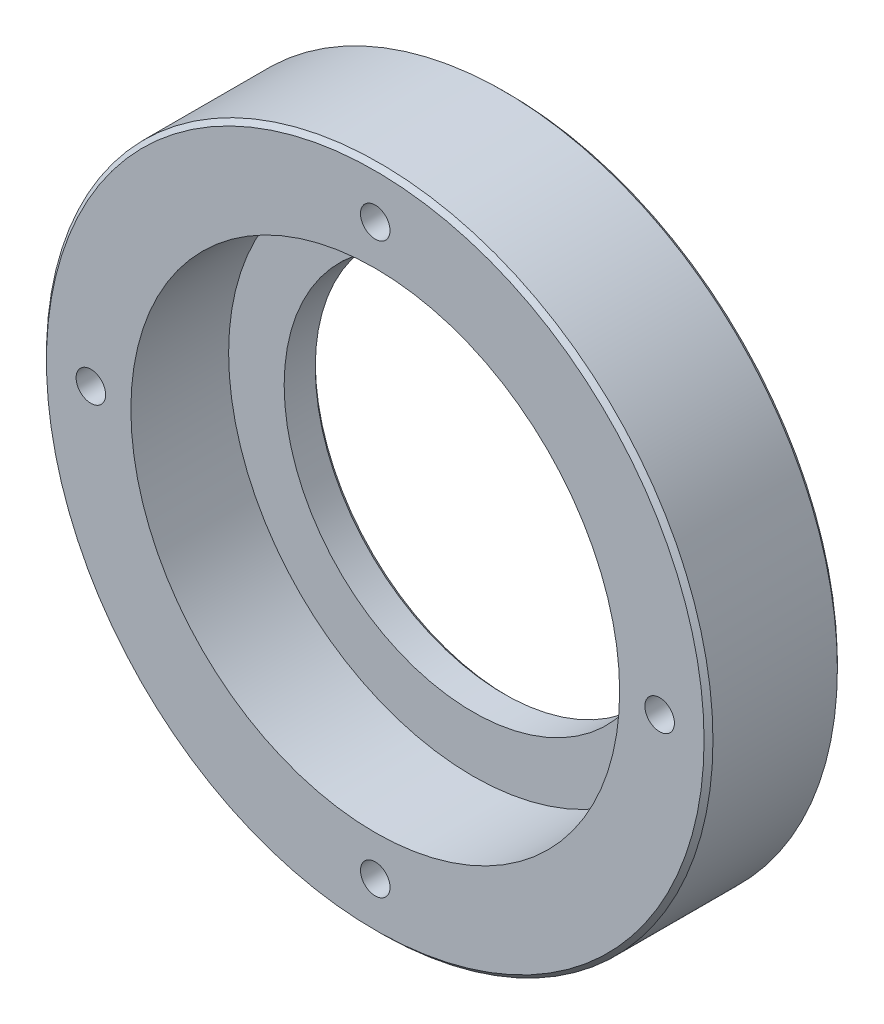
ISO-10303-21;
HEADER;
FILE_DESCRIPTION(('STEP AP214'),'2;1');
FILE_NAME('part.step','',(''),(''),'','','');
FILE_SCHEMA(('AUTOMOTIVE_DESIGN { 1 0 10303 214 1 1 1 1 }'));
ENDSEC;
DATA;
#1=APPLICATION_CONTEXT('core data for automotive mechanical design processes');
#2=APPLICATION_PROTOCOL_DEFINITION('international standard','automotive_design',2000,#1);
#3=PRODUCT_CONTEXT('',#1,'mechanical');
#4=PRODUCT('Part','Part','',(#3));
#5=PRODUCT_RELATED_PRODUCT_CATEGORY('part','',(#4));
#6=PRODUCT_DEFINITION_FORMATION('','',#4);
#7=PRODUCT_DEFINITION_CONTEXT('part definition',#1,'design');
#8=PRODUCT_DEFINITION('design','',#6,#7);
#9=PRODUCT_DEFINITION_SHAPE('','',#8);
#10=(LENGTH_UNIT() NAMED_UNIT(*) SI_UNIT(.MILLI.,.METRE.));
#11=(NAMED_UNIT(*) PLANE_ANGLE_UNIT() SI_UNIT($,.RADIAN.));
#12=(NAMED_UNIT(*) SI_UNIT($,.STERADIAN.) SOLID_ANGLE_UNIT());
#13=UNCERTAINTY_MEASURE_WITH_UNIT(LENGTH_MEASURE(1.E-05),#10,'distance_accuracy_value','');
#14=(GEOMETRIC_REPRESENTATION_CONTEXT(3) GLOBAL_UNCERTAINTY_ASSIGNED_CONTEXT((#13)) GLOBAL_UNIT_ASSIGNED_CONTEXT((#10,
#11,#12)) REPRESENTATION_CONTEXT('',''));
#15=CARTESIAN_POINT('',(0.,0.,0.));
#16=DIRECTION('',(0.,0.,1.));
#17=DIRECTION('',(1.,0.,0.));
#18=AXIS2_PLACEMENT_3D('',#15,#16,#17);
#19=CARTESIAN_POINT('',(0.,0.,0.));
#20=DIRECTION('',(0.,0.,1.));
#21=DIRECTION('',(1.,0.,0.));
#22=AXIS2_PLACEMENT_3D('',#19,#20,#21);
#23=CYLINDRICAL_SURFACE('',#22,75.);
#24=CARTESIAN_POINT('',(0.,0.,0.99999999999778));
#25=DIRECTION('',(0.,0.,-1.));
#26=DIRECTION('',(-1.,0.,0.));
#27=AXIS2_PLACEMENT_3D('',#24,#25,#26);
#28=CIRCLE('',#27,75.);
#29=CARTESIAN_POINT('',(-75.,0.,0.99999999999778));
#30=VERTEX_POINT('',#29);
#31=EDGE_CURVE('E41',#30,#30,#28,.F.);
#32=ORIENTED_EDGE('',*,*,#31,.T.);
#33=EDGE_LOOP('',(#32));
#34=FACE_BOUND('',#33,.T.);
#35=CARTESIAN_POINT('',(0.,0.,28.999999999997));
#36=DIRECTION('',(0.,0.,1.));
#37=DIRECTION('',(1.,0.,0.));
#38=AXIS2_PLACEMENT_3D('',#35,#36,#37);
#39=CIRCLE('',#38,75.);
#40=CARTESIAN_POINT('',(75.,0.,28.999999999997));
#41=VERTEX_POINT('',#40);
#42=EDGE_CURVE('E141',#41,#41,#39,.F.);
#43=ORIENTED_EDGE('',*,*,#42,.T.);
#44=EDGE_LOOP('',(#43));
#45=FACE_BOUND('',#44,.T.);
#46=ADVANCED_FACE('F33',(#34,#45),#23,.T.);
#47=CARTESIAN_POINT('',(75.,0.,0.));
#48=DIRECTION('',(0.,0.,-1.));
#49=DIRECTION('',(-1.,0.,0.));
#50=AXIS2_PLACEMENT_3D('',#47,#48,#49);
#51=PLANE('',#50);
#52=CARTESIAN_POINT('',(0.,0.,0.));
#53=DIRECTION('',(0.,0.,-1.));
#54=DIRECTION('',(-1.,0.,0.));
#55=AXIS2_PLACEMENT_3D('',#52,#53,#54);
#56=CIRCLE('',#55,43.4999999999978);
#57=CARTESIAN_POINT('',(-43.4999999999978,0.,0.));
#58=VERTEX_POINT('',#57);
#59=EDGE_CURVE('E135',#58,#58,#56,.F.);
#60=ORIENTED_EDGE('',*,*,#59,.T.);
#61=EDGE_LOOP('',(#60));
#62=FACE_BOUND('',#61,.T.);
#63=CARTESIAN_POINT('',(0.,0.,0.));
#64=DIRECTION('',(0.,0.,-1.));
#65=DIRECTION('',(-1.,0.,0.));
#66=AXIS2_PLACEMENT_3D('',#63,#64,#65);
#67=CIRCLE('',#66,73.9999999999971);
#68=CARTESIAN_POINT('',(-73.9999999999971,0.,0.));
#69=VERTEX_POINT('',#68);
#70=EDGE_CURVE('E132',#69,#69,#67,.T.);
#71=ORIENTED_EDGE('',*,*,#70,.T.);
#72=EDGE_LOOP('',(#71));
#73=FACE_BOUND('',#72,.T.);
#74=CARTESIAN_POINT('',(-45.254833995939,45.2548339959391,0.));
#75=DIRECTION('',(0.,0.,-1.));
#76=DIRECTION('',(-1.,0.,0.));
#77=AXIS2_PLACEMENT_3D('',#74,#75,#76);
#78=CIRCLE('',#77,4.188);
#79=CARTESIAN_POINT('',(-49.442833995939,45.2548339959391,0.));
#80=VERTEX_POINT('',#79);
#81=EDGE_CURVE('E99',#80,#80,#78,.T.);
#82=ORIENTED_EDGE('',*,*,#81,.F.);
#83=EDGE_LOOP('',(#82));
#84=FACE_BOUND('',#83,.T.);
#85=CARTESIAN_POINT('',(45.2548339959391,45.254833995939,0.));
#86=DIRECTION('',(0.,0.,-1.));
#87=DIRECTION('',(-1.,0.,0.));
#88=AXIS2_PLACEMENT_3D('',#85,#86,#87);
#89=CIRCLE('',#88,4.188);
#90=CARTESIAN_POINT('',(41.0668339959391,45.254833995939,0.));
#91=VERTEX_POINT('',#90);
#92=EDGE_CURVE('E105',#91,#91,#89,.T.);
#93=ORIENTED_EDGE('',*,*,#92,.F.);
#94=EDGE_LOOP('',(#93));
#95=FACE_BOUND('',#94,.T.);
#96=CARTESIAN_POINT('',(45.254833995939,-45.2548339959391,0.));
#97=DIRECTION('',(0.,0.,-1.));
#98=DIRECTION('',(-1.,0.,0.));
#99=AXIS2_PLACEMENT_3D('',#96,#97,#98);
#100=CIRCLE('',#99,4.188);
#101=CARTESIAN_POINT('',(41.066833995939,-45.2548339959391,0.));
#102=VERTEX_POINT('',#101);
#103=EDGE_CURVE('E111',#102,#102,#100,.T.);
#104=ORIENTED_EDGE('',*,*,#103,.F.);
#105=EDGE_LOOP('',(#104));
#106=FACE_BOUND('',#105,.T.);
#107=CARTESIAN_POINT('',(-45.2548339959391,-45.254833995939,0.));
#108=DIRECTION('',(0.,0.,-1.));
#109=DIRECTION('',(-1.,0.,0.));
#110=AXIS2_PLACEMENT_3D('',#107,#108,#109);
#111=CIRCLE('',#110,4.188);
#112=CARTESIAN_POINT('',(-49.4428339959391,-45.254833995939,0.));
#113=VERTEX_POINT('',#112);
#114=EDGE_CURVE('E117',#113,#113,#111,.T.);
#115=ORIENTED_EDGE('',*,*,#114,.F.);
#116=EDGE_LOOP('',(#115));
#117=FACE_BOUND('',#116,.T.);
#118=ADVANCED_FACE('F161',(#62,#73,#84,#95,#106,#117),#51,.T.);
#119=CARTESIAN_POINT('',(0.,0.,30.));
#120=DIRECTION('',(0.,0.,1.));
#121=DIRECTION('',(1.,0.,0.));
#122=AXIS2_PLACEMENT_3D('',#119,#120,#121);
#123=PLANE('',#122);
#124=CARTESIAN_POINT('',(0.,0.,30.));
#125=DIRECTION('',(0.,0.,1.));
#126=DIRECTION('',(1.,0.,0.));
#127=AXIS2_PLACEMENT_3D('',#124,#125,#126);
#128=CIRCLE('',#127,74.0000000000021);
#129=CARTESIAN_POINT('',(74.0000000000021,0.,30.));
#130=VERTEX_POINT('',#129);
#131=EDGE_CURVE('E11',#130,#130,#128,.T.);
#132=ORIENTED_EDGE('',*,*,#131,.T.);
#133=EDGE_LOOP('',(#132));
#134=FACE_BOUND('',#133,.T.);
#135=CARTESIAN_POINT('',(0.,64.,30.));
#136=DIRECTION('',(0.,0.,1.));
#137=DIRECTION('',(1.,0.,0.));
#138=AXIS2_PLACEMENT_3D('',#135,#136,#137);
#139=CIRCLE('',#138,3.32349999999999);
#140=CARTESIAN_POINT('',(3.32349999999997,64.,30.));
#141=VERTEX_POINT('',#140);
#142=EDGE_CURVE('E77',#141,#141,#139,.T.);
#143=ORIENTED_EDGE('',*,*,#142,.F.);
#144=EDGE_LOOP('',(#143));
#145=FACE_BOUND('',#144,.T.);
#146=CARTESIAN_POINT('',(0.,-64.,30.));
#147=DIRECTION('',(0.,0.,1.));
#148=DIRECTION('',(1.,0.,0.));
#149=AXIS2_PLACEMENT_3D('',#146,#147,#148);
#150=CIRCLE('',#149,3.32349999999999);
#151=CARTESIAN_POINT('',(3.32349999999999,-64.,30.));
#152=VERTEX_POINT('',#151);
#153=EDGE_CURVE('E76',#152,#152,#150,.T.);
#154=ORIENTED_EDGE('',*,*,#153,.F.);
#155=EDGE_LOOP('',(#154));
#156=FACE_BOUND('',#155,.T.);
#157=CARTESIAN_POINT('',(64.,0.,30.));
#158=DIRECTION('',(0.,0.,1.));
#159=DIRECTION('',(1.,0.,0.));
#160=AXIS2_PLACEMENT_3D('',#157,#158,#159);
#161=CIRCLE('',#160,3.32349999999999);
#162=CARTESIAN_POINT('',(67.3235,0.,30.));
#163=VERTEX_POINT('',#162);
#164=EDGE_CURVE('E87',#163,#163,#161,.T.);
#165=ORIENTED_EDGE('',*,*,#164,.F.);
#166=EDGE_LOOP('',(#165));
#167=FACE_BOUND('',#166,.T.);
#168=CARTESIAN_POINT('',(-64.,0.,30.));
#169=DIRECTION('',(0.,0.,1.));
#170=DIRECTION('',(1.,0.,0.));
#171=AXIS2_PLACEMENT_3D('',#168,#169,#170);
#172=CIRCLE('',#171,3.32349999999999);
#173=CARTESIAN_POINT('',(-60.6765,0.,30.));
#174=VERTEX_POINT('',#173);
#175=EDGE_CURVE('E93',#174,#174,#172,.T.);
#176=ORIENTED_EDGE('',*,*,#175,.F.);
#177=EDGE_LOOP('',(#176));
#178=FACE_BOUND('',#177,.T.);
#179=CARTESIAN_POINT('',(0.,0.,30.));
#180=DIRECTION('',(0.,0.,1.));
#181=DIRECTION('',(1.,0.,0.));
#182=AXIS2_PLACEMENT_3D('',#179,#180,#181);
#183=CIRCLE('',#182,55.);
#184=CARTESIAN_POINT('',(55.,0.,30.));
#185=VERTEX_POINT('',#184);
#186=EDGE_CURVE('E123',#185,#185,#183,.T.);
#187=ORIENTED_EDGE('',*,*,#186,.F.);
#188=EDGE_LOOP('',(#187));
#189=FACE_BOUND('',#188,.T.);
#190=ADVANCED_FACE('F166',(#134,#145,#156,#167,#178,#189),#123,.T.);
#191=CARTESIAN_POINT('',(0.,0.,30.));
#192=DIRECTION('',(0.,0.,1.));
#193=DIRECTION('',(1.,0.,0.));
#194=AXIS2_PLACEMENT_3D('',#191,#192,#193);
#195=CYLINDRICAL_SURFACE('',#194,42.5);
#196=CARTESIAN_POINT('',(0.,0.,1.00000000000289));
#197=DIRECTION('',(0.,0.,-1.));
#198=DIRECTION('',(-1.,0.,0.));
#199=AXIS2_PLACEMENT_3D('',#196,#197,#198);
#200=CIRCLE('',#199,42.5);
#201=CARTESIAN_POINT('',(-42.5,0.,1.00000000000289));
#202=VERTEX_POINT('',#201);
#203=EDGE_CURVE('E138',#202,#202,#200,.T.);
#204=ORIENTED_EDGE('',*,*,#203,.T.);
#205=EDGE_LOOP('',(#204));
#206=FACE_BOUND('',#205,.T.);
#207=CARTESIAN_POINT('',(0.,0.,8.));
#208=DIRECTION('',(0.,0.,1.));
#209=DIRECTION('',(1.,0.,0.));
#210=AXIS2_PLACEMENT_3D('',#207,#208,#209);
#211=CIRCLE('',#210,42.5);
#212=CARTESIAN_POINT('',(42.5,0.,8.));
#213=VERTEX_POINT('',#212);
#214=EDGE_CURVE('E129',#213,#213,#211,.T.);
#215=ORIENTED_EDGE('',*,*,#214,.T.);
#216=EDGE_LOOP('',(#215));
#217=FACE_BOUND('',#216,.T.);
#218=ADVANCED_FACE('F172',(#206,#217),#195,.F.);
#219=CARTESIAN_POINT('',(42.5,0.,8.));
#220=DIRECTION('',(0.,0.,-1.));
#221=DIRECTION('',(-1.,0.,0.));
#222=AXIS2_PLACEMENT_3D('',#219,#220,#221);
#223=PLANE('',#222);
#224=ORIENTED_EDGE('',*,*,#214,.F.);
#225=EDGE_LOOP('',(#224));
#226=FACE_BOUND('',#225,.T.);
#227=CARTESIAN_POINT('',(0.,0.,8.));
#228=DIRECTION('',(0.,0.,1.));
#229=DIRECTION('',(1.,0.,0.));
#230=AXIS2_PLACEMENT_3D('',#227,#228,#229);
#231=CIRCLE('',#230,55.);
#232=CARTESIAN_POINT('',(55.,0.,8.));
#233=VERTEX_POINT('',#232);
#234=EDGE_CURVE('E126',#233,#233,#231,.T.);
#235=ORIENTED_EDGE('',*,*,#234,.T.);
#236=EDGE_LOOP('',(#235));
#237=FACE_BOUND('',#236,.T.);
#238=ADVANCED_FACE('F176',(#226,#237),#223,.F.);
#239=CARTESIAN_POINT('',(0.,0.,30.));
#240=DIRECTION('',(0.,0.,1.));
#241=DIRECTION('',(1.,0.,0.));
#242=AXIS2_PLACEMENT_3D('',#239,#240,#241);
#243=CYLINDRICAL_SURFACE('',#242,55.);
#244=ORIENTED_EDGE('',*,*,#234,.F.);
#245=EDGE_LOOP('',(#244));
#246=FACE_BOUND('',#245,.T.);
#247=ORIENTED_EDGE('',*,*,#186,.T.);
#248=EDGE_LOOP('',(#247));
#249=FACE_BOUND('',#248,.T.);
#250=ADVANCED_FACE('F180',(#246,#249),#243,.F.);
#251=CARTESIAN_POINT('',(-45.2548339959391,-45.254833995939,20.));
#252=DIRECTION('',(0.,0.,-1.));
#253=DIRECTION('',(-1.,0.,0.));
#254=AXIS2_PLACEMENT_3D('',#251,#252,#253);
#255=CONICAL_SURFACE('',#254,4.188,1.02974425858967);
#256=CARTESIAN_POINT('',(-45.2548339959391,-45.254833995939,22.5164042729832));
#257=VERTEX_POINT('',#256);
#258=VERTEX_LOOP('',#257);
#259=FACE_BOUND('',#258,.T.);
#260=CARTESIAN_POINT('',(-45.2548339959391,-45.254833995939,20.));
#261=DIRECTION('',(0.,0.,-1.));
#262=DIRECTION('',(-1.,0.,0.));
#263=AXIS2_PLACEMENT_3D('',#260,#261,#262);
#264=CIRCLE('',#263,4.188);
#265=CARTESIAN_POINT('',(-49.4428339959391,-45.254833995939,20.));
#266=VERTEX_POINT('',#265);
#267=EDGE_CURVE('E120',#266,#266,#264,.T.);
#268=ORIENTED_EDGE('',*,*,#267,.T.);
#269=EDGE_LOOP('',(#268));
#270=FACE_BOUND('',#269,.T.);
#271=ADVANCED_FACE('F184',(#259,#270),#255,.F.);
#272=CARTESIAN_POINT('',(-45.2548339959391,-45.254833995939,0.));
#273=DIRECTION('',(0.,0.,-1.));
#274=DIRECTION('',(-1.,0.,0.));
#275=AXIS2_PLACEMENT_3D('',#272,#273,#274);
#276=CYLINDRICAL_SURFACE('',#275,4.188);
#277=ORIENTED_EDGE('',*,*,#267,.F.);
#278=EDGE_LOOP('',(#277));
#279=FACE_BOUND('',#278,.T.);
#280=ORIENTED_EDGE('',*,*,#114,.T.);
#281=EDGE_LOOP('',(#280));
#282=FACE_BOUND('',#281,.T.);
#283=ADVANCED_FACE('F188',(#279,#282),#276,.F.);
#284=CARTESIAN_POINT('',(45.254833995939,-45.2548339959391,20.));
#285=DIRECTION('',(0.,0.,-1.));
#286=DIRECTION('',(-1.,0.,0.));
#287=AXIS2_PLACEMENT_3D('',#284,#285,#286);
#288=CONICAL_SURFACE('',#287,4.188,1.02974425858967);
#289=CARTESIAN_POINT('',(45.254833995939,-45.2548339959391,22.5164042729832));
#290=VERTEX_POINT('',#289);
#291=VERTEX_LOOP('',#290);
#292=FACE_BOUND('',#291,.T.);
#293=CARTESIAN_POINT('',(45.254833995939,-45.2548339959391,20.));
#294=DIRECTION('',(0.,0.,-1.));
#295=DIRECTION('',(-1.,0.,0.));
#296=AXIS2_PLACEMENT_3D('',#293,#294,#295);
#297=CIRCLE('',#296,4.188);
#298=CARTESIAN_POINT('',(41.066833995939,-45.2548339959391,20.));
#299=VERTEX_POINT('',#298);
#300=EDGE_CURVE('E114',#299,#299,#297,.T.);
#301=ORIENTED_EDGE('',*,*,#300,.T.);
#302=EDGE_LOOP('',(#301));
#303=FACE_BOUND('',#302,.T.);
#304=ADVANCED_FACE('F191',(#292,#303),#288,.F.);
#305=CARTESIAN_POINT('',(45.254833995939,-45.2548339959391,0.));
#306=DIRECTION('',(0.,0.,-1.));
#307=DIRECTION('',(-1.,0.,0.));
#308=AXIS2_PLACEMENT_3D('',#305,#306,#307);
#309=CYLINDRICAL_SURFACE('',#308,4.188);
#310=ORIENTED_EDGE('',*,*,#300,.F.);
#311=EDGE_LOOP('',(#310));
#312=FACE_BOUND('',#311,.T.);
#313=ORIENTED_EDGE('',*,*,#103,.T.);
#314=EDGE_LOOP('',(#313));
#315=FACE_BOUND('',#314,.T.);
#316=ADVANCED_FACE('F195',(#312,#315),#309,.F.);
#317=CARTESIAN_POINT('',(45.2548339959391,45.254833995939,20.));
#318=DIRECTION('',(0.,0.,-1.));
#319=DIRECTION('',(-1.,0.,0.));
#320=AXIS2_PLACEMENT_3D('',#317,#318,#319);
#321=CONICAL_SURFACE('',#320,4.188,1.02974425858967);
#322=CARTESIAN_POINT('',(45.2548339959391,45.254833995939,22.5164042729832));
#323=VERTEX_POINT('',#322);
#324=VERTEX_LOOP('',#323);
#325=FACE_BOUND('',#324,.T.);
#326=CARTESIAN_POINT('',(45.2548339959391,45.254833995939,20.));
#327=DIRECTION('',(0.,0.,-1.));
#328=DIRECTION('',(-1.,0.,0.));
#329=AXIS2_PLACEMENT_3D('',#326,#327,#328);
#330=CIRCLE('',#329,4.188);
#331=CARTESIAN_POINT('',(41.0668339959391,45.254833995939,20.));
#332=VERTEX_POINT('',#331);
#333=EDGE_CURVE('E108',#332,#332,#330,.T.);
#334=ORIENTED_EDGE('',*,*,#333,.T.);
#335=EDGE_LOOP('',(#334));
#336=FACE_BOUND('',#335,.T.);
#337=ADVANCED_FACE('F198',(#325,#336),#321,.F.);
#338=CARTESIAN_POINT('',(45.2548339959391,45.254833995939,0.));
#339=DIRECTION('',(0.,0.,-1.));
#340=DIRECTION('',(-1.,0.,0.));
#341=AXIS2_PLACEMENT_3D('',#338,#339,#340);
#342=CYLINDRICAL_SURFACE('',#341,4.188);
#343=ORIENTED_EDGE('',*,*,#333,.F.);
#344=EDGE_LOOP('',(#343));
#345=FACE_BOUND('',#344,.T.);
#346=ORIENTED_EDGE('',*,*,#92,.T.);
#347=EDGE_LOOP('',(#346));
#348=FACE_BOUND('',#347,.T.);
#349=ADVANCED_FACE('F202',(#345,#348),#342,.F.);
#350=CARTESIAN_POINT('',(-45.254833995939,45.2548339959391,20.));
#351=DIRECTION('',(0.,0.,-1.));
#352=DIRECTION('',(-1.,0.,0.));
#353=AXIS2_PLACEMENT_3D('',#350,#351,#352);
#354=CONICAL_SURFACE('',#353,4.188,1.02974425858967);
#355=CARTESIAN_POINT('',(-45.254833995939,45.2548339959391,22.5164042729832));
#356=VERTEX_POINT('',#355);
#357=VERTEX_LOOP('',#356);
#358=FACE_BOUND('',#357,.T.);
#359=CARTESIAN_POINT('',(-45.254833995939,45.2548339959391,20.));
#360=DIRECTION('',(0.,0.,-1.));
#361=DIRECTION('',(-1.,0.,0.));
#362=AXIS2_PLACEMENT_3D('',#359,#360,#361);
#363=CIRCLE('',#362,4.188);
#364=CARTESIAN_POINT('',(-49.442833995939,45.2548339959391,20.));
#365=VERTEX_POINT('',#364);
#366=EDGE_CURVE('E102',#365,#365,#363,.T.);
#367=ORIENTED_EDGE('',*,*,#366,.T.);
#368=EDGE_LOOP('',(#367));
#369=FACE_BOUND('',#368,.T.);
#370=ADVANCED_FACE('F206',(#358,#369),#354,.F.);
#371=CARTESIAN_POINT('',(-45.254833995939,45.2548339959391,0.));
#372=DIRECTION('',(0.,0.,-1.));
#373=DIRECTION('',(-1.,0.,0.));
#374=AXIS2_PLACEMENT_3D('',#371,#372,#373);
#375=CYLINDRICAL_SURFACE('',#374,4.188);
#376=ORIENTED_EDGE('',*,*,#366,.F.);
#377=EDGE_LOOP('',(#376));
#378=FACE_BOUND('',#377,.T.);
#379=ORIENTED_EDGE('',*,*,#81,.T.);
#380=EDGE_LOOP('',(#379));
#381=FACE_BOUND('',#380,.T.);
#382=ADVANCED_FACE('F210',(#378,#381),#375,.F.);
#383=CARTESIAN_POINT('',(-64.,0.,18.));
#384=DIRECTION('',(0.,0.,1.));
#385=DIRECTION('',(1.,0.,0.));
#386=AXIS2_PLACEMENT_3D('',#383,#384,#385);
#387=CONICAL_SURFACE('',#386,3.32349999999999,1.02974425864145);
#388=CARTESIAN_POINT('',(-64.,0.,16.0030397325027));
#389=VERTEX_POINT('',#388);
#390=VERTEX_LOOP('',#389);
#391=FACE_BOUND('',#390,.T.);
#392=CARTESIAN_POINT('',(-64.,0.,18.));
#393=DIRECTION('',(0.,0.,1.));
#394=DIRECTION('',(1.,0.,0.));
#395=AXIS2_PLACEMENT_3D('',#392,#393,#394);
#396=CIRCLE('',#395,3.32349999999999);
#397=CARTESIAN_POINT('',(-60.6765,0.,18.));
#398=VERTEX_POINT('',#397);
#399=EDGE_CURVE('E96',#398,#398,#396,.T.);
#400=ORIENTED_EDGE('',*,*,#399,.T.);
#401=EDGE_LOOP('',(#400));
#402=FACE_BOUND('',#401,.T.);
#403=ADVANCED_FACE('F214',(#391,#402),#387,.F.);
#404=CARTESIAN_POINT('',(-64.,0.,30.));
#405=DIRECTION('',(0.,0.,1.));
#406=DIRECTION('',(1.,0.,0.));
#407=AXIS2_PLACEMENT_3D('',#404,#405,#406);
#408=CYLINDRICAL_SURFACE('',#407,3.32349999999999);
#409=ORIENTED_EDGE('',*,*,#399,.F.);
#410=EDGE_LOOP('',(#409));
#411=FACE_BOUND('',#410,.T.);
#412=ORIENTED_EDGE('',*,*,#175,.T.);
#413=EDGE_LOOP('',(#412));
#414=FACE_BOUND('',#413,.T.);
#415=ADVANCED_FACE('F218',(#411,#414),#408,.F.);
#416=CARTESIAN_POINT('',(64.,0.,18.));
#417=DIRECTION('',(0.,0.,1.));
#418=DIRECTION('',(1.,0.,0.));
#419=AXIS2_PLACEMENT_3D('',#416,#417,#418);
#420=CONICAL_SURFACE('',#419,3.32349999999999,1.02974425864145);
#421=CARTESIAN_POINT('',(64.,0.,16.0030397325027));
#422=VERTEX_POINT('',#421);
#423=VERTEX_LOOP('',#422);
#424=FACE_BOUND('',#423,.T.);
#425=CARTESIAN_POINT('',(64.,0.,18.));
#426=DIRECTION('',(0.,0.,1.));
#427=DIRECTION('',(1.,0.,0.));
#428=AXIS2_PLACEMENT_3D('',#425,#426,#427);
#429=CIRCLE('',#428,3.32349999999999);
#430=CARTESIAN_POINT('',(67.3235,0.,18.));
#431=VERTEX_POINT('',#430);
#432=EDGE_CURVE('E90',#431,#431,#429,.T.);
#433=ORIENTED_EDGE('',*,*,#432,.T.);
#434=EDGE_LOOP('',(#433));
#435=FACE_BOUND('',#434,.T.);
#436=ADVANCED_FACE('F222',(#424,#435),#420,.F.);
#437=CARTESIAN_POINT('',(64.,0.,30.));
#438=DIRECTION('',(0.,0.,1.));
#439=DIRECTION('',(1.,0.,0.));
#440=AXIS2_PLACEMENT_3D('',#437,#438,#439);
#441=CYLINDRICAL_SURFACE('',#440,3.32349999999999);
#442=ORIENTED_EDGE('',*,*,#432,.F.);
#443=EDGE_LOOP('',(#442));
#444=FACE_BOUND('',#443,.T.);
#445=ORIENTED_EDGE('',*,*,#164,.T.);
#446=EDGE_LOOP('',(#445));
#447=FACE_BOUND('',#446,.T.);
#448=ADVANCED_FACE('F226',(#444,#447),#441,.F.);
#449=CARTESIAN_POINT('',(0.,-64.,18.));
#450=DIRECTION('',(0.,0.,1.));
#451=DIRECTION('',(1.,0.,0.));
#452=AXIS2_PLACEMENT_3D('',#449,#450,#451);
#453=CONICAL_SURFACE('',#452,3.32349999999999,1.02974425864145);
#454=CARTESIAN_POINT('',(0.,-64.,16.0030397325027));
#455=VERTEX_POINT('',#454);
#456=VERTEX_LOOP('',#455);
#457=FACE_BOUND('',#456,.T.);
#458=CARTESIAN_POINT('',(0.,-64.,18.));
#459=DIRECTION('',(0.,0.,1.));
#460=DIRECTION('',(1.,0.,0.));
#461=AXIS2_PLACEMENT_3D('',#458,#459,#460);
#462=CIRCLE('',#461,3.32349999999999);
#463=CARTESIAN_POINT('',(3.32349999999998,-64.,18.));
#464=VERTEX_POINT('',#463);
#465=EDGE_CURVE('E80',#464,#464,#462,.T.);
#466=ORIENTED_EDGE('',*,*,#465,.T.);
#467=EDGE_LOOP('',(#466));
#468=FACE_BOUND('',#467,.T.);
#469=ADVANCED_FACE('F230',(#457,#468),#453,.F.);
#470=CARTESIAN_POINT('',(0.,-64.,30.));
#471=DIRECTION('',(0.,0.,1.));
#472=DIRECTION('',(1.,0.,0.));
#473=AXIS2_PLACEMENT_3D('',#470,#471,#472);
#474=CYLINDRICAL_SURFACE('',#473,3.32349999999999);
#475=ORIENTED_EDGE('',*,*,#465,.F.);
#476=EDGE_LOOP('',(#475));
#477=FACE_BOUND('',#476,.T.);
#478=ORIENTED_EDGE('',*,*,#153,.T.);
#479=EDGE_LOOP('',(#478));
#480=FACE_BOUND('',#479,.T.);
#481=ADVANCED_FACE('F70',(#477,#480),#474,.F.);
#482=CARTESIAN_POINT('',(0.,64.,18.));
#483=DIRECTION('',(0.,0.,1.));
#484=DIRECTION('',(1.,0.,0.));
#485=AXIS2_PLACEMENT_3D('',#482,#483,#484);
#486=CONICAL_SURFACE('',#485,3.32349999999999,1.02974425864145);
#487=CARTESIAN_POINT('',(0.,64.,16.0030397325027));
#488=VERTEX_POINT('',#487);
#489=VERTEX_LOOP('',#488);
#490=FACE_BOUND('',#489,.T.);
#491=CARTESIAN_POINT('',(0.,64.,18.));
#492=DIRECTION('',(0.,0.,1.));
#493=DIRECTION('',(1.,0.,0.));
#494=AXIS2_PLACEMENT_3D('',#491,#492,#493);
#495=CIRCLE('',#494,3.32349999999999);
#496=CARTESIAN_POINT('',(3.32349999999997,64.,18.));
#497=VERTEX_POINT('',#496);
#498=EDGE_CURVE('E74',#497,#497,#495,.T.);
#499=ORIENTED_EDGE('',*,*,#498,.T.);
#500=EDGE_LOOP('',(#499));
#501=FACE_BOUND('',#500,.T.);
#502=ADVANCED_FACE('F66',(#490,#501),#486,.F.);
#503=CARTESIAN_POINT('',(0.,64.,30.));
#504=DIRECTION('',(0.,0.,1.));
#505=DIRECTION('',(1.,0.,0.));
#506=AXIS2_PLACEMENT_3D('',#503,#504,#505);
#507=CYLINDRICAL_SURFACE('',#506,3.32349999999999);
#508=ORIENTED_EDGE('',*,*,#498,.F.);
#509=EDGE_LOOP('',(#508));
#510=FACE_BOUND('',#509,.T.);
#511=ORIENTED_EDGE('',*,*,#142,.T.);
#512=EDGE_LOOP('',(#511));
#513=FACE_BOUND('',#512,.T.);
#514=ADVANCED_FACE('F69',(#510,#513),#507,.F.);
#515=CARTESIAN_POINT('',(0.,0.,0.));
#516=DIRECTION('',(0.,0.,-1.));
#517=DIRECTION('',(-1.,0.,0.));
#518=AXIS2_PLACEMENT_3D('',#515,#516,#517);
#519=CONICAL_SURFACE('',#518,43.4999999999978,0.785398163394891);
#520=ORIENTED_EDGE('',*,*,#203,.F.);
#521=EDGE_LOOP('',(#520));
#522=FACE_BOUND('',#521,.T.);
#523=ORIENTED_EDGE('',*,*,#59,.F.);
#524=EDGE_LOOP('',(#523));
#525=FACE_BOUND('',#524,.T.);
#526=ADVANCED_FACE('F150',(#522,#525),#519,.F.);
#527=CARTESIAN_POINT('',(0.,0.,0.99999999999778));
#528=DIRECTION('',(0.,0.,1.));
#529=DIRECTION('',(1.,0.,0.));
#530=AXIS2_PLACEMENT_3D('',#527,#528,#529);
#531=CONICAL_SURFACE('',#530,75.,0.785398163399995);
#532=ORIENTED_EDGE('',*,*,#70,.F.);
#533=EDGE_LOOP('',(#532));
#534=FACE_BOUND('',#533,.T.);
#535=ORIENTED_EDGE('',*,*,#31,.F.);
#536=EDGE_LOOP('',(#535));
#537=FACE_BOUND('',#536,.T.);
#538=ADVANCED_FACE('F148',(#534,#537),#531,.T.);
#539=CARTESIAN_POINT('',(0.,0.,30.));
#540=DIRECTION('',(0.,0.,-1.));
#541=DIRECTION('',(-1.,0.,0.));
#542=AXIS2_PLACEMENT_3D('',#539,#540,#541);
#543=CONICAL_SURFACE('',#542,74.0000000000021,0.785398163394895);
#544=ORIENTED_EDGE('',*,*,#42,.F.);
#545=EDGE_LOOP('',(#544));
#546=FACE_BOUND('',#545,.T.);
#547=ORIENTED_EDGE('',*,*,#131,.F.);
#548=EDGE_LOOP('',(#547));
#549=FACE_BOUND('',#548,.T.);
#550=ADVANCED_FACE('F35',(#546,#549),#543,.T.);
#551=CLOSED_SHELL('',(#46,#118,#190,#218,#238,#250,#271,#283,#304,#316,#337,#349,#370,#382,#403,
#415,#436,#448,#469,#481,#502,#514,#526,#538,#550));
#552=MANIFOLD_SOLID_BREP('B2',#551);
#553=ADVANCED_BREP_SHAPE_REPRESENTATION('',(#18,#552),#14);
#554=SHAPE_DEFINITION_REPRESENTATION(#9,#553);
ENDSEC;
END-ISO-10303-21;
